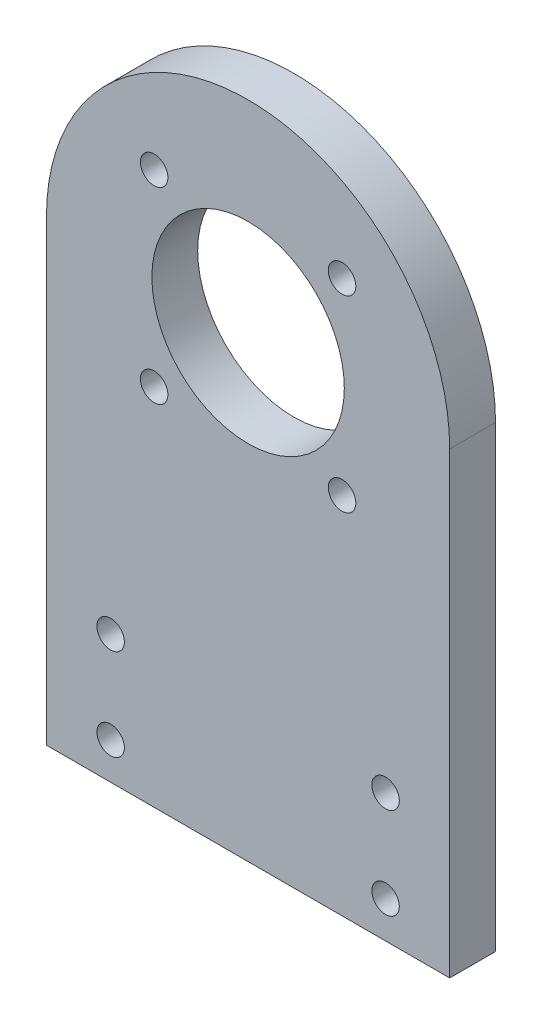
ISO-10303-21;
HEADER;
FILE_DESCRIPTION(('STEP AP214'),'2;1');
FILE_NAME('part.step','',(''),(''),'','','');
FILE_SCHEMA(('AUTOMOTIVE_DESIGN { 1 0 10303 214 1 1 1 1 }'));
ENDSEC;
DATA;
#1=APPLICATION_CONTEXT('core data for automotive mechanical design processes');
#2=APPLICATION_PROTOCOL_DEFINITION('international standard','automotive_design',2000,#1);
#3=PRODUCT_CONTEXT('',#1,'mechanical');
#4=PRODUCT('Part','Part','',(#3));
#5=PRODUCT_RELATED_PRODUCT_CATEGORY('part','',(#4));
#6=PRODUCT_DEFINITION_FORMATION('','',#4);
#7=PRODUCT_DEFINITION_CONTEXT('part definition',#1,'design');
#8=PRODUCT_DEFINITION('design','',#6,#7);
#9=PRODUCT_DEFINITION_SHAPE('','',#8);
#10=(LENGTH_UNIT() NAMED_UNIT(*) SI_UNIT(.MILLI.,.METRE.));
#11=(NAMED_UNIT(*) PLANE_ANGLE_UNIT() SI_UNIT($,.RADIAN.));
#12=(NAMED_UNIT(*) SI_UNIT($,.STERADIAN.) SOLID_ANGLE_UNIT());
#13=UNCERTAINTY_MEASURE_WITH_UNIT(LENGTH_MEASURE(1.E-05),#10,'distance_accuracy_value','');
#14=(GEOMETRIC_REPRESENTATION_CONTEXT(3) GLOBAL_UNCERTAINTY_ASSIGNED_CONTEXT((#13)) GLOBAL_UNIT_ASSIGNED_CONTEXT((#10,
#11,#12)) REPRESENTATION_CONTEXT('',''));
#15=CARTESIAN_POINT('',(0.,0.,0.));
#16=DIRECTION('',(0.,0.,1.));
#17=DIRECTION('',(1.,0.,0.));
#18=AXIS2_PLACEMENT_3D('',#15,#16,#17);
#19=CARTESIAN_POINT('',(1.17961196366423E-13,50.,5.));
#20=DIRECTION('',(0.,0.,1.));
#21=DIRECTION('',(1.,0.,0.));
#22=AXIS2_PLACEMENT_3D('',#19,#20,#21);
#23=PLANE('',#22);
#24=CARTESIAN_POINT('',(-10.2530483272048,39.7469516727951,5.));
#25=DIRECTION('',(0.,0.,-1.));
#26=DIRECTION('',(-1.,0.,0.));
#27=AXIS2_PLACEMENT_3D('',#24,#25,#26);
#28=CIRCLE('',#27,1.5);
#29=CARTESIAN_POINT('',(-11.7530483272048,39.7469516727951,5.));
#30=VERTEX_POINT('',#29);
#31=EDGE_CURVE('E148',#30,#30,#28,.T.);
#32=ORIENTED_EDGE('',*,*,#31,.T.);
#33=EDGE_LOOP('',(#32));
#34=FACE_BOUND('',#33,.T.);
#35=CARTESIAN_POINT('',(10.253048327205,39.7469516727951,5.));
#36=DIRECTION('',(0.,0.,-1.));
#37=DIRECTION('',(-1.,0.,0.));
#38=AXIS2_PLACEMENT_3D('',#35,#36,#37);
#39=CIRCLE('',#38,1.5);
#40=CARTESIAN_POINT('',(8.75304832720504,39.7469516727951,5.));
#41=VERTEX_POINT('',#40);
#42=EDGE_CURVE('E160',#41,#41,#39,.T.);
#43=ORIENTED_EDGE('',*,*,#42,.T.);
#44=EDGE_LOOP('',(#43));
#45=FACE_BOUND('',#44,.T.);
#46=CARTESIAN_POINT('',(10.2530483272051,60.2530483272049,5.));
#47=DIRECTION('',(0.,0.,-1.));
#48=DIRECTION('',(-1.,0.,0.));
#49=AXIS2_PLACEMENT_3D('',#46,#47,#48);
#50=CIRCLE('',#49,1.50000000000001);
#51=CARTESIAN_POINT('',(8.75304832720507,60.2530483272049,5.));
#52=VERTEX_POINT('',#51);
#53=EDGE_CURVE('E154',#52,#52,#50,.T.);
#54=ORIENTED_EDGE('',*,*,#53,.T.);
#55=EDGE_LOOP('',(#54));
#56=FACE_BOUND('',#55,.T.);
#57=CARTESIAN_POINT('',(-10.2530483272048,60.253048327205,5.));
#58=DIRECTION('',(0.,0.,-1.));
#59=DIRECTION('',(-1.,0.,0.));
#60=AXIS2_PLACEMENT_3D('',#57,#58,#59);
#61=CIRCLE('',#60,1.5);
#62=CARTESIAN_POINT('',(-11.7530483272048,60.253048327205,5.));
#63=VERTEX_POINT('',#62);
#64=EDGE_CURVE('E142',#63,#63,#61,.T.);
#65=ORIENTED_EDGE('',*,*,#64,.T.);
#66=EDGE_LOOP('',(#65));
#67=FACE_BOUND('',#66,.T.);
#68=CARTESIAN_POINT('',(15.,14.,5.));
#69=DIRECTION('',(0.,0.,1.));
#70=DIRECTION('',(-1.,0.,0.));
#71=AXIS2_PLACEMENT_3D('',#68,#69,#70);
#72=CIRCLE('',#71,1.5);
#73=CARTESIAN_POINT('',(13.5,14.,5.));
#74=VERTEX_POINT('',#73);
#75=EDGE_CURVE('E130',#74,#74,#72,.T.);
#76=ORIENTED_EDGE('',*,*,#75,.F.);
#77=EDGE_LOOP('',(#76));
#78=FACE_BOUND('',#77,.T.);
#79=CARTESIAN_POINT('',(-15.,4.,5.));
#80=DIRECTION('',(0.,0.,1.));
#81=DIRECTION('',(1.,0.,0.));
#82=AXIS2_PLACEMENT_3D('',#79,#80,#81);
#83=CIRCLE('',#82,1.5);
#84=CARTESIAN_POINT('',(-13.5,4.,5.));
#85=VERTEX_POINT('',#84);
#86=EDGE_CURVE('E118',#85,#85,#83,.T.);
#87=ORIENTED_EDGE('',*,*,#86,.F.);
#88=EDGE_LOOP('',(#87));
#89=FACE_BOUND('',#88,.T.);
#90=DIRECTION('',(0.,-1.,0.));
#91=VECTOR('',#90,1.);
#92=CARTESIAN_POINT('',(-22.,0.,5.));
#93=LINE('',#92,#91);
#94=CARTESIAN_POINT('',(-21.9999999999999,50.,5.));
#95=VERTEX_POINT('',#94);
#96=CARTESIAN_POINT('',(-22.,0.,5.));
#97=VERTEX_POINT('',#96);
#98=EDGE_CURVE('E88',#95,#97,#93,.T.);
#99=ORIENTED_EDGE('',*,*,#98,.T.);
#100=DIRECTION('',(1.,0.,0.));
#101=VECTOR('',#100,1.);
#102=CARTESIAN_POINT('',(-22.,0.,5.));
#103=LINE('',#102,#101);
#104=CARTESIAN_POINT('',(22.,0.,5.));
#105=VERTEX_POINT('',#104);
#106=EDGE_CURVE('E83',#97,#105,#103,.T.);
#107=ORIENTED_EDGE('',*,*,#106,.T.);
#108=DIRECTION('',(0.,1.,0.));
#109=VECTOR('',#108,1.);
#110=CARTESIAN_POINT('',(22.,0.,5.));
#111=LINE('',#110,#109);
#112=CARTESIAN_POINT('',(22.,50.,5.));
#113=VERTEX_POINT('',#112);
#114=EDGE_CURVE('E86',#105,#113,#111,.T.);
#115=ORIENTED_EDGE('',*,*,#114,.T.);
#116=CARTESIAN_POINT('',(1.17961196366423E-13,50.,5.));
#117=DIRECTION('',(0.,0.,1.));
#118=DIRECTION('',(1.,0.,0.));
#119=AXIS2_PLACEMENT_3D('',#116,#117,#118);
#120=CIRCLE('',#119,22.);
#121=EDGE_CURVE('E53',#113,#95,#120,.T.);
#122=ORIENTED_EDGE('',*,*,#121,.T.);
#123=EDGE_LOOP('',(#99,#107,#115,#122));
#124=FACE_BOUND('',#123,.T.);
#125=CARTESIAN_POINT('',(-15.,14.,5.));
#126=DIRECTION('',(0.,0.,1.));
#127=DIRECTION('',(1.,0.,0.));
#128=AXIS2_PLACEMENT_3D('',#125,#126,#127);
#129=CIRCLE('',#128,1.5);
#130=CARTESIAN_POINT('',(-13.5,14.,5.));
#131=VERTEX_POINT('',#130);
#132=EDGE_CURVE('E103',#131,#131,#129,.T.);
#133=ORIENTED_EDGE('',*,*,#132,.F.);
#134=EDGE_LOOP('',(#133));
#135=FACE_BOUND('',#134,.T.);
#136=CARTESIAN_POINT('',(15.,4.,5.));
#137=DIRECTION('',(0.,0.,1.));
#138=DIRECTION('',(-1.,0.,0.));
#139=AXIS2_PLACEMENT_3D('',#136,#137,#138);
#140=CIRCLE('',#139,1.5);
#141=CARTESIAN_POINT('',(13.5,4.,5.));
#142=VERTEX_POINT('',#141);
#143=EDGE_CURVE('E124',#142,#142,#140,.T.);
#144=ORIENTED_EDGE('',*,*,#143,.F.);
#145=EDGE_LOOP('',(#144));
#146=FACE_BOUND('',#145,.T.);
#147=CARTESIAN_POINT('',(1.17961196366423E-13,50.,5.));
#148=DIRECTION('',(0.,0.,1.));
#149=DIRECTION('',(1.,0.,0.));
#150=AXIS2_PLACEMENT_3D('',#147,#148,#149);
#151=CIRCLE('',#150,10.5);
#152=CARTESIAN_POINT('',(10.5000000000001,50.,5.));
#153=VERTEX_POINT('',#152);
#154=EDGE_CURVE('E136',#153,#153,#151,.T.);
#155=ORIENTED_EDGE('',*,*,#154,.F.);
#156=EDGE_LOOP('',(#155));
#157=FACE_BOUND('',#156,.T.);
#158=ADVANCED_FACE('F36',(#34,#45,#56,#67,#78,#89,#124,#135,#146,#157),#23,.T.);
#159=CARTESIAN_POINT('',(1.17961196366423E-13,50.,0.));
#160=DIRECTION('',(0.,0.,1.));
#161=DIRECTION('',(1.,0.,0.));
#162=AXIS2_PLACEMENT_3D('',#159,#160,#161);
#163=PLANE('',#162);
#164=CARTESIAN_POINT('',(-10.2530483272048,39.7469516727951,0.));
#165=DIRECTION('',(0.,0.,-1.));
#166=DIRECTION('',(-1.,0.,0.));
#167=AXIS2_PLACEMENT_3D('',#164,#165,#166);
#168=CIRCLE('',#167,1.5);
#169=CARTESIAN_POINT('',(-11.7530483272048,39.7469516727951,0.));
#170=VERTEX_POINT('',#169);
#171=EDGE_CURVE('E163',#170,#170,#168,.T.);
#172=ORIENTED_EDGE('',*,*,#171,.F.);
#173=EDGE_LOOP('',(#172));
#174=FACE_BOUND('',#173,.T.);
#175=CARTESIAN_POINT('',(10.253048327205,39.7469516727951,0.));
#176=DIRECTION('',(0.,0.,-1.));
#177=DIRECTION('',(-1.,0.,0.));
#178=AXIS2_PLACEMENT_3D('',#175,#176,#177);
#179=CIRCLE('',#178,1.5);
#180=CARTESIAN_POINT('',(8.75304832720504,39.7469516727951,0.));
#181=VERTEX_POINT('',#180);
#182=EDGE_CURVE('E157',#181,#181,#179,.T.);
#183=ORIENTED_EDGE('',*,*,#182,.F.);
#184=EDGE_LOOP('',(#183));
#185=FACE_BOUND('',#184,.T.);
#186=CARTESIAN_POINT('',(10.2530483272051,60.2530483272049,0.));
#187=DIRECTION('',(0.,0.,-1.));
#188=DIRECTION('',(-1.,0.,0.));
#189=AXIS2_PLACEMENT_3D('',#186,#187,#188);
#190=CIRCLE('',#189,1.50000000000001);
#191=CARTESIAN_POINT('',(8.75304832720507,60.2530483272049,0.));
#192=VERTEX_POINT('',#191);
#193=EDGE_CURVE('E151',#192,#192,#190,.T.);
#194=ORIENTED_EDGE('',*,*,#193,.F.);
#195=EDGE_LOOP('',(#194));
#196=FACE_BOUND('',#195,.T.);
#197=CARTESIAN_POINT('',(-10.2530483272048,60.253048327205,0.));
#198=DIRECTION('',(0.,0.,-1.));
#199=DIRECTION('',(-1.,0.,0.));
#200=AXIS2_PLACEMENT_3D('',#197,#198,#199);
#201=CIRCLE('',#200,1.5);
#202=CARTESIAN_POINT('',(-11.7530483272048,60.253048327205,0.));
#203=VERTEX_POINT('',#202);
#204=EDGE_CURVE('E145',#203,#203,#201,.T.);
#205=ORIENTED_EDGE('',*,*,#204,.F.);
#206=EDGE_LOOP('',(#205));
#207=FACE_BOUND('',#206,.T.);
#208=DIRECTION('',(0.,-1.,0.));
#209=VECTOR('',#208,1.);
#210=CARTESIAN_POINT('',(-22.,0.,0.));
#211=LINE('',#210,#209);
#212=CARTESIAN_POINT('',(-21.9999999999999,50.,0.));
#213=VERTEX_POINT('',#212);
#214=CARTESIAN_POINT('',(-22.,0.,0.));
#215=VERTEX_POINT('',#214);
#216=EDGE_CURVE('E100',#213,#215,#211,.T.);
#217=ORIENTED_EDGE('',*,*,#216,.F.);
#218=CARTESIAN_POINT('',(1.17961196366423E-13,50.,0.));
#219=DIRECTION('',(0.,0.,1.));
#220=DIRECTION('',(1.,0.,0.));
#221=AXIS2_PLACEMENT_3D('',#218,#219,#220);
#222=CIRCLE('',#221,22.);
#223=CARTESIAN_POINT('',(22.,50.,0.));
#224=VERTEX_POINT('',#223);
#225=EDGE_CURVE('E76',#224,#213,#222,.T.);
#226=ORIENTED_EDGE('',*,*,#225,.F.);
#227=DIRECTION('',(0.,1.,0.));
#228=VECTOR('',#227,1.);
#229=CARTESIAN_POINT('',(22.,0.,0.));
#230=LINE('',#229,#228);
#231=CARTESIAN_POINT('',(22.,0.,0.));
#232=VERTEX_POINT('',#231);
#233=EDGE_CURVE('E70',#232,#224,#230,.T.);
#234=ORIENTED_EDGE('',*,*,#233,.F.);
#235=DIRECTION('',(1.,0.,0.));
#236=VECTOR('',#235,1.);
#237=CARTESIAN_POINT('',(-22.,0.,0.));
#238=LINE('',#237,#236);
#239=EDGE_CURVE('E92',#215,#232,#238,.T.);
#240=ORIENTED_EDGE('',*,*,#239,.F.);
#241=EDGE_LOOP('',(#217,#226,#234,#240));
#242=FACE_BOUND('',#241,.T.);
#243=CARTESIAN_POINT('',(-15.,14.,0.));
#244=DIRECTION('',(0.,0.,1.));
#245=DIRECTION('',(1.,0.,0.));
#246=AXIS2_PLACEMENT_3D('',#243,#244,#245);
#247=CIRCLE('',#246,1.5);
#248=CARTESIAN_POINT('',(-13.5,14.,0.));
#249=VERTEX_POINT('',#248);
#250=EDGE_CURVE('E115',#249,#249,#247,.T.);
#251=ORIENTED_EDGE('',*,*,#250,.T.);
#252=EDGE_LOOP('',(#251));
#253=FACE_BOUND('',#252,.T.);
#254=CARTESIAN_POINT('',(-15.,4.,0.));
#255=DIRECTION('',(0.,0.,1.));
#256=DIRECTION('',(1.,0.,0.));
#257=AXIS2_PLACEMENT_3D('',#254,#255,#256);
#258=CIRCLE('',#257,1.5);
#259=CARTESIAN_POINT('',(-13.5,4.,0.));
#260=VERTEX_POINT('',#259);
#261=EDGE_CURVE('E121',#260,#260,#258,.T.);
#262=ORIENTED_EDGE('',*,*,#261,.T.);
#263=EDGE_LOOP('',(#262));
#264=FACE_BOUND('',#263,.T.);
#265=CARTESIAN_POINT('',(15.,4.,0.));
#266=DIRECTION('',(0.,0.,1.));
#267=DIRECTION('',(-1.,0.,0.));
#268=AXIS2_PLACEMENT_3D('',#265,#266,#267);
#269=CIRCLE('',#268,1.5);
#270=CARTESIAN_POINT('',(13.5,4.,0.));
#271=VERTEX_POINT('',#270);
#272=EDGE_CURVE('E127',#271,#271,#269,.T.);
#273=ORIENTED_EDGE('',*,*,#272,.T.);
#274=EDGE_LOOP('',(#273));
#275=FACE_BOUND('',#274,.T.);
#276=CARTESIAN_POINT('',(15.,14.,0.));
#277=DIRECTION('',(0.,0.,1.));
#278=DIRECTION('',(-1.,0.,0.));
#279=AXIS2_PLACEMENT_3D('',#276,#277,#278);
#280=CIRCLE('',#279,1.5);
#281=CARTESIAN_POINT('',(13.5,14.,0.));
#282=VERTEX_POINT('',#281);
#283=EDGE_CURVE('E133',#282,#282,#280,.T.);
#284=ORIENTED_EDGE('',*,*,#283,.T.);
#285=EDGE_LOOP('',(#284));
#286=FACE_BOUND('',#285,.T.);
#287=CARTESIAN_POINT('',(1.17961196366423E-13,50.,0.));
#288=DIRECTION('',(0.,0.,1.));
#289=DIRECTION('',(1.,0.,0.));
#290=AXIS2_PLACEMENT_3D('',#287,#288,#289);
#291=CIRCLE('',#290,10.5);
#292=CARTESIAN_POINT('',(10.5000000000001,50.,0.));
#293=VERTEX_POINT('',#292);
#294=EDGE_CURVE('E139',#293,#293,#291,.T.);
#295=ORIENTED_EDGE('',*,*,#294,.T.);
#296=EDGE_LOOP('',(#295));
#297=FACE_BOUND('',#296,.T.);
#298=ADVANCED_FACE('F111',(#174,#185,#196,#207,#242,#253,#264,#275,#286,#297),#163,.F.);
#299=CARTESIAN_POINT('',(-22.,0.,5.));
#300=DIRECTION('',(1.,0.,0.));
#301=DIRECTION('',(0.,0.,-1.));
#302=AXIS2_PLACEMENT_3D('',#299,#300,#301);
#303=PLANE('',#302);
#304=ORIENTED_EDGE('',*,*,#216,.T.);
#305=DIRECTION('',(0.,0.,-1.));
#306=VECTOR('',#305,1.);
#307=CARTESIAN_POINT('',(-22.,0.,5.));
#308=LINE('',#307,#306);
#309=EDGE_CURVE('E11',#97,#215,#308,.T.);
#310=ORIENTED_EDGE('',*,*,#309,.F.);
#311=ORIENTED_EDGE('',*,*,#98,.F.);
#312=DIRECTION('',(0.,0.,-1.));
#313=VECTOR('',#312,1.);
#314=CARTESIAN_POINT('',(-21.9999999999999,50.,5.));
#315=LINE('',#314,#313);
#316=EDGE_CURVE('E96',#95,#213,#315,.T.);
#317=ORIENTED_EDGE('',*,*,#316,.T.);
#318=EDGE_LOOP('',(#304,#310,#311,#317));
#319=FACE_BOUND('',#318,.T.);
#320=ADVANCED_FACE('F38',(#319),#303,.F.);
#321=CARTESIAN_POINT('',(-22.,0.,5.));
#322=DIRECTION('',(0.,1.,0.));
#323=DIRECTION('',(-1.,0.,0.));
#324=AXIS2_PLACEMENT_3D('',#321,#322,#323);
#325=PLANE('',#324);
#326=ORIENTED_EDGE('',*,*,#239,.T.);
#327=DIRECTION('',(0.,0.,-1.));
#328=VECTOR('',#327,1.);
#329=CARTESIAN_POINT('',(22.,0.,5.));
#330=LINE('',#329,#328);
#331=EDGE_CURVE('E45',#105,#232,#330,.T.);
#332=ORIENTED_EDGE('',*,*,#331,.F.);
#333=ORIENTED_EDGE('',*,*,#106,.F.);
#334=ORIENTED_EDGE('',*,*,#309,.T.);
#335=EDGE_LOOP('',(#326,#332,#333,#334));
#336=FACE_BOUND('',#335,.T.);
#337=ADVANCED_FACE('F91',(#336),#325,.F.);
#338=CARTESIAN_POINT('',(22.,0.,5.));
#339=DIRECTION('',(-1.,0.,0.));
#340=DIRECTION('',(0.,-1.,0.));
#341=AXIS2_PLACEMENT_3D('',#338,#339,#340);
#342=PLANE('',#341);
#343=ORIENTED_EDGE('',*,*,#233,.T.);
#344=DIRECTION('',(0.,0.,-1.));
#345=VECTOR('',#344,1.);
#346=CARTESIAN_POINT('',(22.,50.,5.));
#347=LINE('',#346,#345);
#348=EDGE_CURVE('E93',#113,#224,#347,.T.);
#349=ORIENTED_EDGE('',*,*,#348,.F.);
#350=ORIENTED_EDGE('',*,*,#114,.F.);
#351=ORIENTED_EDGE('',*,*,#331,.T.);
#352=EDGE_LOOP('',(#343,#349,#350,#351));
#353=FACE_BOUND('',#352,.T.);
#354=ADVANCED_FACE('F94',(#353),#342,.F.);
#355=CARTESIAN_POINT('',(1.17961196366423E-13,50.,5.));
#356=DIRECTION('',(0.,0.,-1.));
#357=DIRECTION('',(-1.,0.,0.));
#358=AXIS2_PLACEMENT_3D('',#355,#356,#357);
#359=CYLINDRICAL_SURFACE('',#358,22.);
#360=ORIENTED_EDGE('',*,*,#225,.T.);
#361=ORIENTED_EDGE('',*,*,#316,.F.);
#362=ORIENTED_EDGE('',*,*,#121,.F.);
#363=ORIENTED_EDGE('',*,*,#348,.T.);
#364=EDGE_LOOP('',(#360,#361,#362,#363));
#365=FACE_BOUND('',#364,.T.);
#366=ADVANCED_FACE('F108',(#365),#359,.T.);
#367=CARTESIAN_POINT('',(-15.,14.,5.));
#368=DIRECTION('',(0.,0.,-1.));
#369=DIRECTION('',(-1.,0.,0.));
#370=AXIS2_PLACEMENT_3D('',#367,#368,#369);
#371=CYLINDRICAL_SURFACE('',#370,1.5);
#372=ORIENTED_EDGE('',*,*,#132,.T.);
#373=EDGE_LOOP('',(#372));
#374=FACE_BOUND('',#373,.T.);
#375=ORIENTED_EDGE('',*,*,#250,.F.);
#376=EDGE_LOOP('',(#375));
#377=FACE_BOUND('',#376,.T.);
#378=ADVANCED_FACE('F208',(#374,#377),#371,.F.);
#379=CARTESIAN_POINT('',(-15.,4.,5.));
#380=DIRECTION('',(0.,0.,-1.));
#381=DIRECTION('',(-1.,0.,0.));
#382=AXIS2_PLACEMENT_3D('',#379,#380,#381);
#383=CYLINDRICAL_SURFACE('',#382,1.5);
#384=ORIENTED_EDGE('',*,*,#86,.T.);
#385=EDGE_LOOP('',(#384));
#386=FACE_BOUND('',#385,.T.);
#387=ORIENTED_EDGE('',*,*,#261,.F.);
#388=EDGE_LOOP('',(#387));
#389=FACE_BOUND('',#388,.T.);
#390=ADVANCED_FACE('F267',(#386,#389),#383,.F.);
#391=CARTESIAN_POINT('',(15.,4.,5.));
#392=DIRECTION('',(0.,0.,-1.));
#393=DIRECTION('',(-1.,0.,0.));
#394=AXIS2_PLACEMENT_3D('',#391,#392,#393);
#395=CYLINDRICAL_SURFACE('',#394,1.5);
#396=ORIENTED_EDGE('',*,*,#143,.T.);
#397=EDGE_LOOP('',(#396));
#398=FACE_BOUND('',#397,.T.);
#399=ORIENTED_EDGE('',*,*,#272,.F.);
#400=EDGE_LOOP('',(#399));
#401=FACE_BOUND('',#400,.T.);
#402=ADVANCED_FACE('F270',(#398,#401),#395,.F.);
#403=CARTESIAN_POINT('',(15.,14.,5.));
#404=DIRECTION('',(0.,0.,-1.));
#405=DIRECTION('',(-1.,0.,0.));
#406=AXIS2_PLACEMENT_3D('',#403,#404,#405);
#407=CYLINDRICAL_SURFACE('',#406,1.5);
#408=ORIENTED_EDGE('',*,*,#75,.T.);
#409=EDGE_LOOP('',(#408));
#410=FACE_BOUND('',#409,.T.);
#411=ORIENTED_EDGE('',*,*,#283,.F.);
#412=EDGE_LOOP('',(#411));
#413=FACE_BOUND('',#412,.T.);
#414=ADVANCED_FACE('F199',(#410,#413),#407,.F.);
#415=CARTESIAN_POINT('',(1.17961196366423E-13,50.,5.));
#416=DIRECTION('',(0.,0.,-1.));
#417=DIRECTION('',(-1.,0.,0.));
#418=AXIS2_PLACEMENT_3D('',#415,#416,#417);
#419=CYLINDRICAL_SURFACE('',#418,10.5);
#420=ORIENTED_EDGE('',*,*,#154,.T.);
#421=EDGE_LOOP('',(#420));
#422=FACE_BOUND('',#421,.T.);
#423=ORIENTED_EDGE('',*,*,#294,.F.);
#424=EDGE_LOOP('',(#423));
#425=FACE_BOUND('',#424,.T.);
#426=ADVANCED_FACE('F190',(#422,#425),#419,.F.);
#427=CARTESIAN_POINT('',(-10.2530483272048,60.253048327205,5.));
#428=DIRECTION('',(0.,0.,-1.));
#429=DIRECTION('',(-1.,0.,0.));
#430=AXIS2_PLACEMENT_3D('',#427,#428,#429);
#431=CYLINDRICAL_SURFACE('',#430,1.5);
#432=ORIENTED_EDGE('',*,*,#64,.F.);
#433=EDGE_LOOP('',(#432));
#434=FACE_BOUND('',#433,.T.);
#435=ORIENTED_EDGE('',*,*,#204,.T.);
#436=EDGE_LOOP('',(#435));
#437=FACE_BOUND('',#436,.T.);
#438=ADVANCED_FACE('F187',(#434,#437),#431,.F.);
#439=CARTESIAN_POINT('',(10.2530483272051,60.2530483272049,5.));
#440=DIRECTION('',(0.,0.,-1.));
#441=DIRECTION('',(-1.,0.,0.));
#442=AXIS2_PLACEMENT_3D('',#439,#440,#441);
#443=CYLINDRICAL_SURFACE('',#442,1.50000000000001);
#444=ORIENTED_EDGE('',*,*,#53,.F.);
#445=EDGE_LOOP('',(#444));
#446=FACE_BOUND('',#445,.T.);
#447=ORIENTED_EDGE('',*,*,#193,.T.);
#448=EDGE_LOOP('',(#447));
#449=FACE_BOUND('',#448,.T.);
#450=ADVANCED_FACE('F189',(#446,#449),#443,.F.);
#451=CARTESIAN_POINT('',(10.253048327205,39.7469516727951,5.));
#452=DIRECTION('',(0.,0.,-1.));
#453=DIRECTION('',(-1.,0.,0.));
#454=AXIS2_PLACEMENT_3D('',#451,#452,#453);
#455=CYLINDRICAL_SURFACE('',#454,1.5);
#456=ORIENTED_EDGE('',*,*,#42,.F.);
#457=EDGE_LOOP('',(#456));
#458=FACE_BOUND('',#457,.T.);
#459=ORIENTED_EDGE('',*,*,#182,.T.);
#460=EDGE_LOOP('',(#459));
#461=FACE_BOUND('',#460,.T.);
#462=ADVANCED_FACE('F174',(#458,#461),#455,.F.);
#463=CARTESIAN_POINT('',(-10.2530483272048,39.7469516727951,5.));
#464=DIRECTION('',(0.,0.,-1.));
#465=DIRECTION('',(-1.,0.,0.));
#466=AXIS2_PLACEMENT_3D('',#463,#464,#465);
#467=CYLINDRICAL_SURFACE('',#466,1.5);
#468=ORIENTED_EDGE('',*,*,#31,.F.);
#469=EDGE_LOOP('',(#468));
#470=FACE_BOUND('',#469,.T.);
#471=ORIENTED_EDGE('',*,*,#171,.T.);
#472=EDGE_LOOP('',(#471));
#473=FACE_BOUND('',#472,.T.);
#474=ADVANCED_FACE('F171',(#470,#473),#467,.F.);
#475=CLOSED_SHELL('',(#158,#298,#320,#337,#354,#366,#378,#390,#402,#414,#426,#438,#450,#462,#474));
#476=MANIFOLD_SOLID_BREP('B2',#475);
#477=ADVANCED_BREP_SHAPE_REPRESENTATION('',(#18,#476),#14);
#478=SHAPE_DEFINITION_REPRESENTATION(#9,#477);
ENDSEC;
END-ISO-10303-21;
